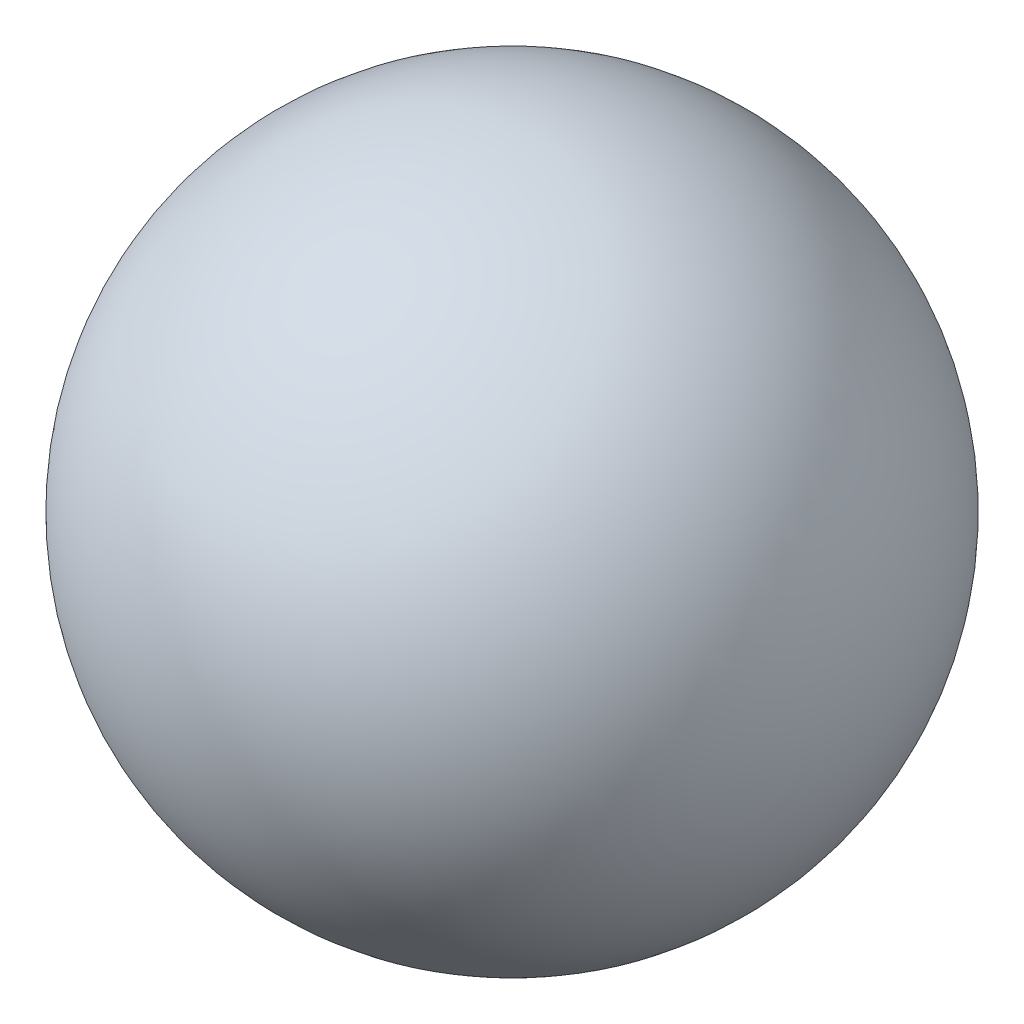
ISO-10303-21;
HEADER;
FILE_DESCRIPTION(('STEP AP214'),'2;1');
FILE_NAME('part.step','',(''),(''),'','','');
FILE_SCHEMA(('AUTOMOTIVE_DESIGN { 1 0 10303 214 1 1 1 1 }'));
ENDSEC;
DATA;
#1=APPLICATION_CONTEXT('core data for automotive mechanical design processes');
#2=APPLICATION_PROTOCOL_DEFINITION('international standard','automotive_design',2000,#1);
#3=PRODUCT_CONTEXT('',#1,'mechanical');
#4=PRODUCT('Part','Part','',(#3));
#5=PRODUCT_RELATED_PRODUCT_CATEGORY('part','',(#4));
#6=PRODUCT_DEFINITION_FORMATION('','',#4);
#7=PRODUCT_DEFINITION_CONTEXT('part definition',#1,'design');
#8=PRODUCT_DEFINITION('design','',#6,#7);
#9=PRODUCT_DEFINITION_SHAPE('','',#8);
#10=(LENGTH_UNIT() NAMED_UNIT(*) SI_UNIT(.MILLI.,.METRE.));
#11=(NAMED_UNIT(*) PLANE_ANGLE_UNIT() SI_UNIT($,.RADIAN.));
#12=(NAMED_UNIT(*) SI_UNIT($,.STERADIAN.) SOLID_ANGLE_UNIT());
#13=UNCERTAINTY_MEASURE_WITH_UNIT(LENGTH_MEASURE(1.E-05),#10,'distance_accuracy_value','');
#14=(GEOMETRIC_REPRESENTATION_CONTEXT(3) GLOBAL_UNCERTAINTY_ASSIGNED_CONTEXT((#13)) GLOBAL_UNIT_ASSIGNED_CONTEXT((#10,
#11,#12)) REPRESENTATION_CONTEXT('',''));
#15=CARTESIAN_POINT('',(0.,0.,0.));
#16=DIRECTION('',(0.,0.,1.));
#17=DIRECTION('',(1.,0.,0.));
#18=AXIS2_PLACEMENT_3D('',#15,#16,#17);
#19=CARTESIAN_POINT('',(0.,11.4983314845628,0.));
#20=DIRECTION('',(0.,1.,0.));
#21=DIRECTION('',(-1.,0.,0.));
#22=AXIS2_PLACEMENT_3D('',#19,#20,#21);
#23=SPHERICAL_SURFACE('',#22,21.35);
#24=CARTESIAN_POINT('',(0.,32.8483314845628,0.));
#25=VERTEX_POINT('',#24);
#26=VERTEX_LOOP('',#25);
#27=FACE_BOUND('',#26,.T.);
#28=ADVANCED_FACE('F30',(#27),#23,.T.);
#29=CLOSED_SHELL('',(#28));
#30=MANIFOLD_SOLID_BREP('B2',#29);
#31=ADVANCED_BREP_SHAPE_REPRESENTATION('',(#18,#30),#14);
#32=SHAPE_DEFINITION_REPRESENTATION(#9,#31);
ENDSEC;
END-ISO-10303-21;
